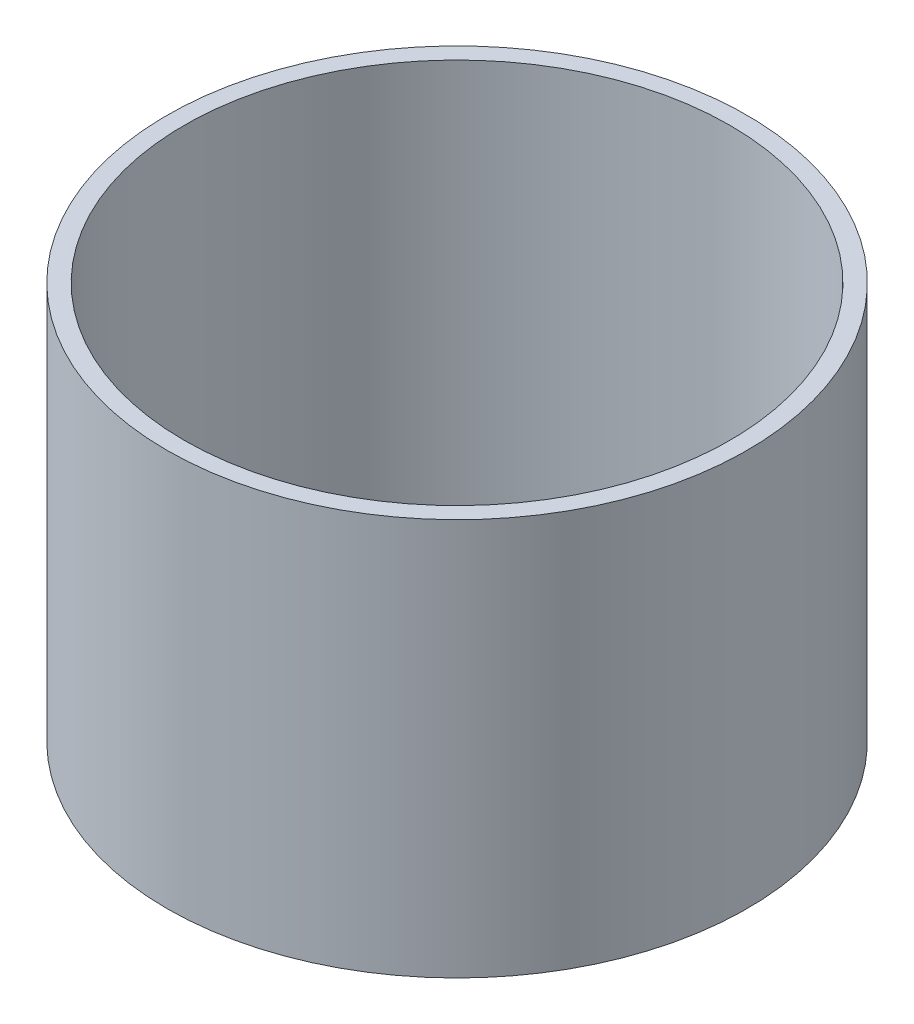
ISO-10303-21;
HEADER;
FILE_DESCRIPTION(('STEP AP214'),'2;1');
FILE_NAME('part.step','',(''),(''),'','','');
FILE_SCHEMA(('AUTOMOTIVE_DESIGN { 1 0 10303 214 1 1 1 1 }'));
ENDSEC;
DATA;
#1=APPLICATION_CONTEXT('core data for automotive mechanical design processes');
#2=APPLICATION_PROTOCOL_DEFINITION('international standard','automotive_design',2000,#1);
#3=PRODUCT_CONTEXT('',#1,'mechanical');
#4=PRODUCT('Part','Part','',(#3));
#5=PRODUCT_RELATED_PRODUCT_CATEGORY('part','',(#4));
#6=PRODUCT_DEFINITION_FORMATION('','',#4);
#7=PRODUCT_DEFINITION_CONTEXT('part definition',#1,'design');
#8=PRODUCT_DEFINITION('design','',#6,#7);
#9=PRODUCT_DEFINITION_SHAPE('','',#8);
#10=(LENGTH_UNIT() NAMED_UNIT(*) SI_UNIT(.MILLI.,.METRE.));
#11=(NAMED_UNIT(*) PLANE_ANGLE_UNIT() SI_UNIT($,.RADIAN.));
#12=(NAMED_UNIT(*) SI_UNIT($,.STERADIAN.) SOLID_ANGLE_UNIT());
#13=UNCERTAINTY_MEASURE_WITH_UNIT(LENGTH_MEASURE(1.E-05),#10,'distance_accuracy_value','');
#14=(GEOMETRIC_REPRESENTATION_CONTEXT(3) GLOBAL_UNCERTAINTY_ASSIGNED_CONTEXT((#13)) GLOBAL_UNIT_ASSIGNED_CONTEXT((#10,
#11,#12)) REPRESENTATION_CONTEXT('',''));
#15=CARTESIAN_POINT('',(0.,0.,0.));
#16=DIRECTION('',(0.,0.,1.));
#17=DIRECTION('',(1.,0.,0.));
#18=AXIS2_PLACEMENT_3D('',#15,#16,#17);
#19=CARTESIAN_POINT('',(0.,-40.,0.));
#20=DIRECTION('',(0.,1.,0.));
#21=DIRECTION('',(0.,0.,1.));
#22=AXIS2_PLACEMENT_3D('',#19,#20,#21);
#23=CYLINDRICAL_SURFACE('',#22,27.5);
#24=CARTESIAN_POINT('',(0.,-40.,0.));
#25=DIRECTION('',(0.,1.,0.));
#26=DIRECTION('',(0.,0.,1.));
#27=AXIS2_PLACEMENT_3D('',#24,#25,#26);
#28=CIRCLE('',#27,27.5);
#29=CARTESIAN_POINT('',(0.,-40.,27.5));
#30=VERTEX_POINT('',#29);
#31=EDGE_CURVE('E37',#30,#30,#28,.T.);
#32=ORIENTED_EDGE('',*,*,#31,.F.);
#33=EDGE_LOOP('',(#32));
#34=FACE_BOUND('',#33,.T.);
#35=CARTESIAN_POINT('',(0.,0.,0.));
#36=DIRECTION('',(0.,1.,0.));
#37=DIRECTION('',(0.,0.,1.));
#38=AXIS2_PLACEMENT_3D('',#35,#36,#37);
#39=CIRCLE('',#38,27.5);
#40=CARTESIAN_POINT('',(0.,0.,27.5));
#41=VERTEX_POINT('',#40);
#42=EDGE_CURVE('E43',#41,#41,#39,.T.);
#43=ORIENTED_EDGE('',*,*,#42,.T.);
#44=EDGE_LOOP('',(#43));
#45=FACE_BOUND('',#44,.T.);
#46=ADVANCED_FACE('F30',(#34,#45),#23,.F.);
#47=CARTESIAN_POINT('',(0.,-40.,0.));
#48=DIRECTION('',(0.,1.,0.));
#49=DIRECTION('',(0.,0.,1.));
#50=AXIS2_PLACEMENT_3D('',#47,#48,#49);
#51=CYLINDRICAL_SURFACE('',#50,29.2395080001266);
#52=CARTESIAN_POINT('',(0.,-40.,0.));
#53=DIRECTION('',(0.,1.,0.));
#54=DIRECTION('',(0.,0.,1.));
#55=AXIS2_PLACEMENT_3D('',#52,#53,#54);
#56=CIRCLE('',#55,29.2395080001266);
#57=CARTESIAN_POINT('',(0.,-40.,29.2395080001266));
#58=VERTEX_POINT('',#57);
#59=EDGE_CURVE('E10',#58,#58,#56,.T.);
#60=ORIENTED_EDGE('',*,*,#59,.T.);
#61=EDGE_LOOP('',(#60));
#62=FACE_BOUND('',#61,.T.);
#63=CARTESIAN_POINT('',(0.,0.,0.));
#64=DIRECTION('',(0.,1.,0.));
#65=DIRECTION('',(0.,0.,1.));
#66=AXIS2_PLACEMENT_3D('',#63,#64,#65);
#67=CIRCLE('',#66,29.2395080001266);
#68=CARTESIAN_POINT('',(0.,0.,29.2395080001266));
#69=VERTEX_POINT('',#68);
#70=EDGE_CURVE('E33',#69,#69,#67,.T.);
#71=ORIENTED_EDGE('',*,*,#70,.F.);
#72=EDGE_LOOP('',(#71));
#73=FACE_BOUND('',#72,.T.);
#74=ADVANCED_FACE('F52',(#62,#73),#51,.T.);
#75=CARTESIAN_POINT('',(0.,-40.,0.));
#76=DIRECTION('',(0.,1.,0.));
#77=DIRECTION('',(0.,0.,1.));
#78=AXIS2_PLACEMENT_3D('',#75,#76,#77);
#79=PLANE('',#78);
#80=ORIENTED_EDGE('',*,*,#31,.T.);
#81=EDGE_LOOP('',(#80));
#82=FACE_BOUND('',#81,.T.);
#83=ORIENTED_EDGE('',*,*,#59,.F.);
#84=EDGE_LOOP('',(#83));
#85=FACE_BOUND('',#84,.T.);
#86=ADVANCED_FACE('F54',(#82,#85),#79,.F.);
#87=CARTESIAN_POINT('',(0.,0.,0.));
#88=DIRECTION('',(0.,1.,0.));
#89=DIRECTION('',(0.,0.,1.));
#90=AXIS2_PLACEMENT_3D('',#87,#88,#89);
#91=PLANE('',#90);
#92=ORIENTED_EDGE('',*,*,#42,.F.);
#93=EDGE_LOOP('',(#92));
#94=FACE_BOUND('',#93,.T.);
#95=ORIENTED_EDGE('',*,*,#70,.T.);
#96=EDGE_LOOP('',(#95));
#97=FACE_BOUND('',#96,.T.);
#98=ADVANCED_FACE('F50',(#94,#97),#91,.T.);
#99=CLOSED_SHELL('',(#46,#74,#86,#98));
#100=MANIFOLD_SOLID_BREP('B2',#99);
#101=ADVANCED_BREP_SHAPE_REPRESENTATION('',(#18,#100),#14);
#102=SHAPE_DEFINITION_REPRESENTATION(#9,#101);
ENDSEC;
END-ISO-10303-21;
